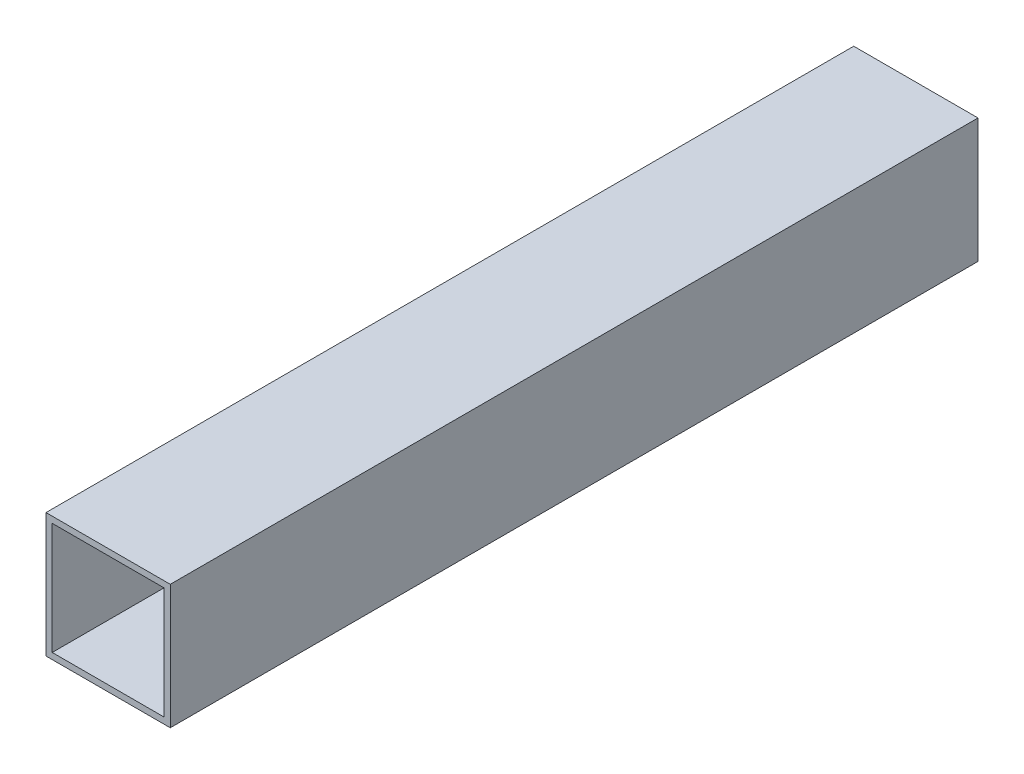
ISO-10303-21;
HEADER;
FILE_DESCRIPTION(('STEP AP214'),'2;1');
FILE_NAME('part.step','',(''),(''),'','','');
FILE_SCHEMA(('AUTOMOTIVE_DESIGN { 1 0 10303 214 1 1 1 1 }'));
ENDSEC;
DATA;
#1=APPLICATION_CONTEXT('core data for automotive mechanical design processes');
#2=APPLICATION_PROTOCOL_DEFINITION('international standard','automotive_design',2000,#1);
#3=PRODUCT_CONTEXT('',#1,'mechanical');
#4=PRODUCT('Part','Part','',(#3));
#5=PRODUCT_RELATED_PRODUCT_CATEGORY('part','',(#4));
#6=PRODUCT_DEFINITION_FORMATION('','',#4);
#7=PRODUCT_DEFINITION_CONTEXT('part definition',#1,'design');
#8=PRODUCT_DEFINITION('design','',#6,#7);
#9=PRODUCT_DEFINITION_SHAPE('','',#8);
#10=(LENGTH_UNIT() NAMED_UNIT(*) SI_UNIT(.MILLI.,.METRE.));
#11=(NAMED_UNIT(*) PLANE_ANGLE_UNIT() SI_UNIT($,.RADIAN.));
#12=(NAMED_UNIT(*) SI_UNIT($,.STERADIAN.) SOLID_ANGLE_UNIT());
#13=UNCERTAINTY_MEASURE_WITH_UNIT(LENGTH_MEASURE(1.E-05),#10,'distance_accuracy_value','');
#14=(GEOMETRIC_REPRESENTATION_CONTEXT(3) GLOBAL_UNCERTAINTY_ASSIGNED_CONTEXT((#13)) GLOBAL_UNIT_ASSIGNED_CONTEXT((#10,
#11,#12)) REPRESENTATION_CONTEXT('',''));
#15=CARTESIAN_POINT('',(0.,0.,0.));
#16=DIRECTION('',(0.,0.,1.));
#17=DIRECTION('',(1.,0.,0.));
#18=AXIS2_PLACEMENT_3D('',#15,#16,#17);
#19=CARTESIAN_POINT('',(0.,0.,325.));
#20=DIRECTION('',(0.,0.,-1.));
#21=DIRECTION('',(-1.,0.,0.));
#22=AXIS2_PLACEMENT_3D('',#19,#20,#21);
#23=PLANE('',#22);
#24=DIRECTION('',(0.,-1.,0.));
#25=VECTOR('',#24,1.);
#26=CARTESIAN_POINT('',(-50.,-50.,325.));
#27=LINE('',#26,#25);
#28=CARTESIAN_POINT('',(-50.,49.9999999999999,325.));
#29=VERTEX_POINT('',#28);
#30=CARTESIAN_POINT('',(-50.,-50.,325.));
#31=VERTEX_POINT('',#30);
#32=EDGE_CURVE('E134',#29,#31,#27,.T.);
#33=ORIENTED_EDGE('',*,*,#32,.T.);
#34=DIRECTION('',(1.,0.,0.));
#35=VECTOR('',#34,1.);
#36=CARTESIAN_POINT('',(-50.,-50.,325.));
#37=LINE('',#36,#35);
#38=CARTESIAN_POINT('',(50.,-50.,325.));
#39=VERTEX_POINT('',#38);
#40=EDGE_CURVE('E137',#31,#39,#37,.T.);
#41=ORIENTED_EDGE('',*,*,#40,.T.);
#42=DIRECTION('',(0.,1.,0.));
#43=VECTOR('',#42,1.);
#44=CARTESIAN_POINT('',(50.,-50.,325.));
#45=LINE('',#44,#43);
#46=CARTESIAN_POINT('',(49.9999999999999,49.9999999999999,325.));
#47=VERTEX_POINT('',#46);
#48=EDGE_CURVE('E140',#39,#47,#45,.T.);
#49=ORIENTED_EDGE('',*,*,#48,.T.);
#50=DIRECTION('',(-1.,0.,0.));
#51=VECTOR('',#50,1.);
#52=CARTESIAN_POINT('',(-50.,49.9999999999999,325.));
#53=LINE('',#52,#51);
#54=EDGE_CURVE('E142',#47,#29,#53,.T.);
#55=ORIENTED_EDGE('',*,*,#54,.T.);
#56=EDGE_LOOP('',(#33,#41,#49,#55));
#57=FACE_BOUND('',#56,.T.);
#58=DIRECTION('',(0.,-1.,0.));
#59=VECTOR('',#58,1.);
#60=CARTESIAN_POINT('',(-45.,-45.,325.));
#61=LINE('',#60,#59);
#62=CARTESIAN_POINT('',(-45.,44.9999999999999,325.));
#63=VERTEX_POINT('',#62);
#64=CARTESIAN_POINT('',(-45.,-45.,325.));
#65=VERTEX_POINT('',#64);
#66=EDGE_CURVE('E98',#63,#65,#61,.T.);
#67=ORIENTED_EDGE('',*,*,#66,.F.);
#68=DIRECTION('',(-1.,0.,0.));
#69=VECTOR('',#68,1.);
#70=CARTESIAN_POINT('',(-45.,44.9999999999999,325.));
#71=LINE('',#70,#69);
#72=CARTESIAN_POINT('',(45.,44.9999999999999,325.));
#73=VERTEX_POINT('',#72);
#74=EDGE_CURVE('E120',#73,#63,#71,.T.);
#75=ORIENTED_EDGE('',*,*,#74,.F.);
#76=DIRECTION('',(0.,1.,0.));
#77=VECTOR('',#76,1.);
#78=CARTESIAN_POINT('',(45.,-45.,325.));
#79=LINE('',#78,#77);
#80=CARTESIAN_POINT('',(45.,-45.,325.));
#81=VERTEX_POINT('',#80);
#82=EDGE_CURVE('E118',#81,#73,#79,.T.);
#83=ORIENTED_EDGE('',*,*,#82,.F.);
#84=DIRECTION('',(1.,0.,0.));
#85=VECTOR('',#84,1.);
#86=CARTESIAN_POINT('',(-45.,-45.,325.));
#87=LINE('',#86,#85);
#88=EDGE_CURVE('E106',#65,#81,#87,.T.);
#89=ORIENTED_EDGE('',*,*,#88,.F.);
#90=EDGE_LOOP('',(#67,#75,#83,#89));
#91=FACE_BOUND('',#90,.T.);
#92=ADVANCED_FACE('F33',(#57,#91),#23,.F.);
#93=CARTESIAN_POINT('',(0.,0.,-325.));
#94=DIRECTION('',(0.,0.,-1.));
#95=DIRECTION('',(-1.,0.,0.));
#96=AXIS2_PLACEMENT_3D('',#93,#94,#95);
#97=PLANE('',#96);
#98=DIRECTION('',(0.,-1.,0.));
#99=VECTOR('',#98,1.);
#100=CARTESIAN_POINT('',(-50.,-50.,-325.));
#101=LINE('',#100,#99);
#102=CARTESIAN_POINT('',(-50.,49.9999999999999,-325.));
#103=VERTEX_POINT('',#102);
#104=CARTESIAN_POINT('',(-50.,-50.,-325.));
#105=VERTEX_POINT('',#104);
#106=EDGE_CURVE('E114',#103,#105,#101,.T.);
#107=ORIENTED_EDGE('',*,*,#106,.F.);
#108=DIRECTION('',(-1.,0.,0.));
#109=VECTOR('',#108,1.);
#110=CARTESIAN_POINT('',(-50.,49.9999999999999,-325.));
#111=LINE('',#110,#109);
#112=CARTESIAN_POINT('',(49.9999999999999,49.9999999999999,-325.));
#113=VERTEX_POINT('',#112);
#114=EDGE_CURVE('E138',#113,#103,#111,.T.);
#115=ORIENTED_EDGE('',*,*,#114,.F.);
#116=DIRECTION('',(0.,1.,0.));
#117=VECTOR('',#116,1.);
#118=CARTESIAN_POINT('',(50.,-50.,-325.));
#119=LINE('',#118,#117);
#120=CARTESIAN_POINT('',(50.,-50.,-325.));
#121=VERTEX_POINT('',#120);
#122=EDGE_CURVE('E149',#121,#113,#119,.T.);
#123=ORIENTED_EDGE('',*,*,#122,.F.);
#124=DIRECTION('',(1.,0.,0.));
#125=VECTOR('',#124,1.);
#126=CARTESIAN_POINT('',(-50.,-50.,-325.));
#127=LINE('',#126,#125);
#128=EDGE_CURVE('E147',#105,#121,#127,.T.);
#129=ORIENTED_EDGE('',*,*,#128,.F.);
#130=EDGE_LOOP('',(#107,#115,#123,#129));
#131=FACE_BOUND('',#130,.T.);
#132=DIRECTION('',(-1.,0.,0.));
#133=VECTOR('',#132,1.);
#134=CARTESIAN_POINT('',(-45.,44.9999999999999,-325.));
#135=LINE('',#134,#133);
#136=CARTESIAN_POINT('',(45.,44.9999999999999,-325.));
#137=VERTEX_POINT('',#136);
#138=CARTESIAN_POINT('',(-45.,44.9999999999999,-325.));
#139=VERTEX_POINT('',#138);
#140=EDGE_CURVE('E107',#137,#139,#135,.T.);
#141=ORIENTED_EDGE('',*,*,#140,.T.);
#142=DIRECTION('',(0.,-1.,0.));
#143=VECTOR('',#142,1.);
#144=CARTESIAN_POINT('',(-45.,-45.,-325.));
#145=LINE('',#144,#143);
#146=CARTESIAN_POINT('',(-45.,-45.,-325.));
#147=VERTEX_POINT('',#146);
#148=EDGE_CURVE('E56',#139,#147,#145,.T.);
#149=ORIENTED_EDGE('',*,*,#148,.T.);
#150=DIRECTION('',(1.,0.,0.));
#151=VECTOR('',#150,1.);
#152=CARTESIAN_POINT('',(-45.,-45.,-325.));
#153=LINE('',#152,#151);
#154=CARTESIAN_POINT('',(45.,-45.,-325.));
#155=VERTEX_POINT('',#154);
#156=EDGE_CURVE('E113',#147,#155,#153,.T.);
#157=ORIENTED_EDGE('',*,*,#156,.T.);
#158=DIRECTION('',(0.,1.,0.));
#159=VECTOR('',#158,1.);
#160=CARTESIAN_POINT('',(45.,-45.,-325.));
#161=LINE('',#160,#159);
#162=EDGE_CURVE('E126',#155,#137,#161,.T.);
#163=ORIENTED_EDGE('',*,*,#162,.T.);
#164=EDGE_LOOP('',(#141,#149,#157,#163));
#165=FACE_BOUND('',#164,.T.);
#166=ADVANCED_FACE('F167',(#131,#165),#97,.T.);
#167=CARTESIAN_POINT('',(-50.,-50.,325.));
#168=DIRECTION('',(1.,0.,0.));
#169=DIRECTION('',(0.,0.,-1.));
#170=AXIS2_PLACEMENT_3D('',#167,#168,#169);
#171=PLANE('',#170);
#172=ORIENTED_EDGE('',*,*,#106,.T.);
#173=DIRECTION('',(0.,0.,-1.));
#174=VECTOR('',#173,1.);
#175=CARTESIAN_POINT('',(-50.,-50.,325.));
#176=LINE('',#175,#174);
#177=EDGE_CURVE('E11',#31,#105,#176,.T.);
#178=ORIENTED_EDGE('',*,*,#177,.F.);
#179=ORIENTED_EDGE('',*,*,#32,.F.);
#180=DIRECTION('',(0.,0.,-1.));
#181=VECTOR('',#180,1.);
#182=CARTESIAN_POINT('',(-50.,49.9999999999999,325.));
#183=LINE('',#182,#181);
#184=EDGE_CURVE('E144',#29,#103,#183,.T.);
#185=ORIENTED_EDGE('',*,*,#184,.T.);
#186=EDGE_LOOP('',(#172,#178,#179,#185));
#187=FACE_BOUND('',#186,.T.);
#188=ADVANCED_FACE('F35',(#187),#171,.F.);
#189=CARTESIAN_POINT('',(-50.,-50.,325.));
#190=DIRECTION('',(0.,1.,0.));
#191=DIRECTION('',(0.,0.,1.));
#192=AXIS2_PLACEMENT_3D('',#189,#190,#191);
#193=PLANE('',#192);
#194=ORIENTED_EDGE('',*,*,#128,.T.);
#195=DIRECTION('',(0.,0.,-1.));
#196=VECTOR('',#195,1.);
#197=CARTESIAN_POINT('',(50.,-50.,325.));
#198=LINE('',#197,#196);
#199=EDGE_CURVE('E41',#39,#121,#198,.T.);
#200=ORIENTED_EDGE('',*,*,#199,.F.);
#201=ORIENTED_EDGE('',*,*,#40,.F.);
#202=ORIENTED_EDGE('',*,*,#177,.T.);
#203=EDGE_LOOP('',(#194,#200,#201,#202));
#204=FACE_BOUND('',#203,.T.);
#205=ADVANCED_FACE('F177',(#204),#193,.F.);
#206=CARTESIAN_POINT('',(50.,-50.,325.));
#207=DIRECTION('',(-1.,0.,0.));
#208=DIRECTION('',(0.,-1.,0.));
#209=AXIS2_PLACEMENT_3D('',#206,#207,#208);
#210=PLANE('',#209);
#211=ORIENTED_EDGE('',*,*,#122,.T.);
#212=DIRECTION('',(0.,0.,-1.));
#213=VECTOR('',#212,1.);
#214=CARTESIAN_POINT('',(49.9999999999999,49.9999999999999,325.));
#215=LINE('',#214,#213);
#216=EDGE_CURVE('E154',#47,#113,#215,.T.);
#217=ORIENTED_EDGE('',*,*,#216,.F.);
#218=ORIENTED_EDGE('',*,*,#48,.F.);
#219=ORIENTED_EDGE('',*,*,#199,.T.);
#220=EDGE_LOOP('',(#211,#217,#218,#219));
#221=FACE_BOUND('',#220,.T.);
#222=ADVANCED_FACE('F161',(#221),#210,.F.);
#223=CARTESIAN_POINT('',(-50.,49.9999999999999,325.));
#224=DIRECTION('',(0.,-1.,0.));
#225=DIRECTION('',(0.,0.,-1.));
#226=AXIS2_PLACEMENT_3D('',#223,#224,#225);
#227=PLANE('',#226);
#228=ORIENTED_EDGE('',*,*,#114,.T.);
#229=ORIENTED_EDGE('',*,*,#184,.F.);
#230=ORIENTED_EDGE('',*,*,#54,.F.);
#231=ORIENTED_EDGE('',*,*,#216,.T.);
#232=EDGE_LOOP('',(#228,#229,#230,#231));
#233=FACE_BOUND('',#232,.T.);
#234=ADVANCED_FACE('F171',(#233),#227,.F.);
#235=CARTESIAN_POINT('',(-45.,-45.,325.));
#236=DIRECTION('',(1.,0.,0.));
#237=DIRECTION('',(0.,0.,-1.));
#238=AXIS2_PLACEMENT_3D('',#235,#236,#237);
#239=PLANE('',#238);
#240=ORIENTED_EDGE('',*,*,#148,.F.);
#241=DIRECTION('',(0.,0.,-1.));
#242=VECTOR('',#241,1.);
#243=CARTESIAN_POINT('',(-45.,44.9999999999999,325.));
#244=LINE('',#243,#242);
#245=EDGE_CURVE('E102',#63,#139,#244,.T.);
#246=ORIENTED_EDGE('',*,*,#245,.F.);
#247=ORIENTED_EDGE('',*,*,#66,.T.);
#248=DIRECTION('',(0.,0.,-1.));
#249=VECTOR('',#248,1.);
#250=CARTESIAN_POINT('',(-45.,-45.,325.));
#251=LINE('',#250,#249);
#252=EDGE_CURVE('E101',#65,#147,#251,.T.);
#253=ORIENTED_EDGE('',*,*,#252,.T.);
#254=EDGE_LOOP('',(#240,#246,#247,#253));
#255=FACE_BOUND('',#254,.T.);
#256=ADVANCED_FACE('F100',(#255),#239,.T.);
#257=CARTESIAN_POINT('',(-45.,-45.,325.));
#258=DIRECTION('',(0.,1.,0.));
#259=DIRECTION('',(0.,0.,1.));
#260=AXIS2_PLACEMENT_3D('',#257,#258,#259);
#261=PLANE('',#260);
#262=ORIENTED_EDGE('',*,*,#156,.F.);
#263=ORIENTED_EDGE('',*,*,#252,.F.);
#264=ORIENTED_EDGE('',*,*,#88,.T.);
#265=DIRECTION('',(0.,0.,-1.));
#266=VECTOR('',#265,1.);
#267=CARTESIAN_POINT('',(45.,-45.,325.));
#268=LINE('',#267,#266);
#269=EDGE_CURVE('E115',#81,#155,#268,.T.);
#270=ORIENTED_EDGE('',*,*,#269,.T.);
#271=EDGE_LOOP('',(#262,#263,#264,#270));
#272=FACE_BOUND('',#271,.T.);
#273=ADVANCED_FACE('F110',(#272),#261,.T.);
#274=CARTESIAN_POINT('',(45.,-45.,325.));
#275=DIRECTION('',(-1.,0.,0.));
#276=DIRECTION('',(0.,-1.,0.));
#277=AXIS2_PLACEMENT_3D('',#274,#275,#276);
#278=PLANE('',#277);
#279=ORIENTED_EDGE('',*,*,#162,.F.);
#280=ORIENTED_EDGE('',*,*,#269,.F.);
#281=ORIENTED_EDGE('',*,*,#82,.T.);
#282=DIRECTION('',(0.,0.,-1.));
#283=VECTOR('',#282,1.);
#284=CARTESIAN_POINT('',(45.,44.9999999999999,325.));
#285=LINE('',#284,#283);
#286=EDGE_CURVE('E48',#73,#137,#285,.T.);
#287=ORIENTED_EDGE('',*,*,#286,.T.);
#288=EDGE_LOOP('',(#279,#280,#281,#287));
#289=FACE_BOUND('',#288,.T.);
#290=ADVANCED_FACE('F200',(#289),#278,.T.);
#291=CARTESIAN_POINT('',(-45.,44.9999999999999,325.));
#292=DIRECTION('',(0.,-1.,0.));
#293=DIRECTION('',(0.,0.,-1.));
#294=AXIS2_PLACEMENT_3D('',#291,#292,#293);
#295=PLANE('',#294);
#296=ORIENTED_EDGE('',*,*,#140,.F.);
#297=ORIENTED_EDGE('',*,*,#286,.F.);
#298=ORIENTED_EDGE('',*,*,#74,.T.);
#299=ORIENTED_EDGE('',*,*,#245,.T.);
#300=EDGE_LOOP('',(#296,#297,#298,#299));
#301=FACE_BOUND('',#300,.T.);
#302=ADVANCED_FACE('F204',(#301),#295,.T.);
#303=CLOSED_SHELL('',(#92,#166,#188,#205,#222,#234,#256,#273,#290,#302));
#304=MANIFOLD_SOLID_BREP('B2',#303);
#305=ADVANCED_BREP_SHAPE_REPRESENTATION('',(#18,#304),#14);
#306=SHAPE_DEFINITION_REPRESENTATION(#9,#305);
ENDSEC;
END-ISO-10303-21;
